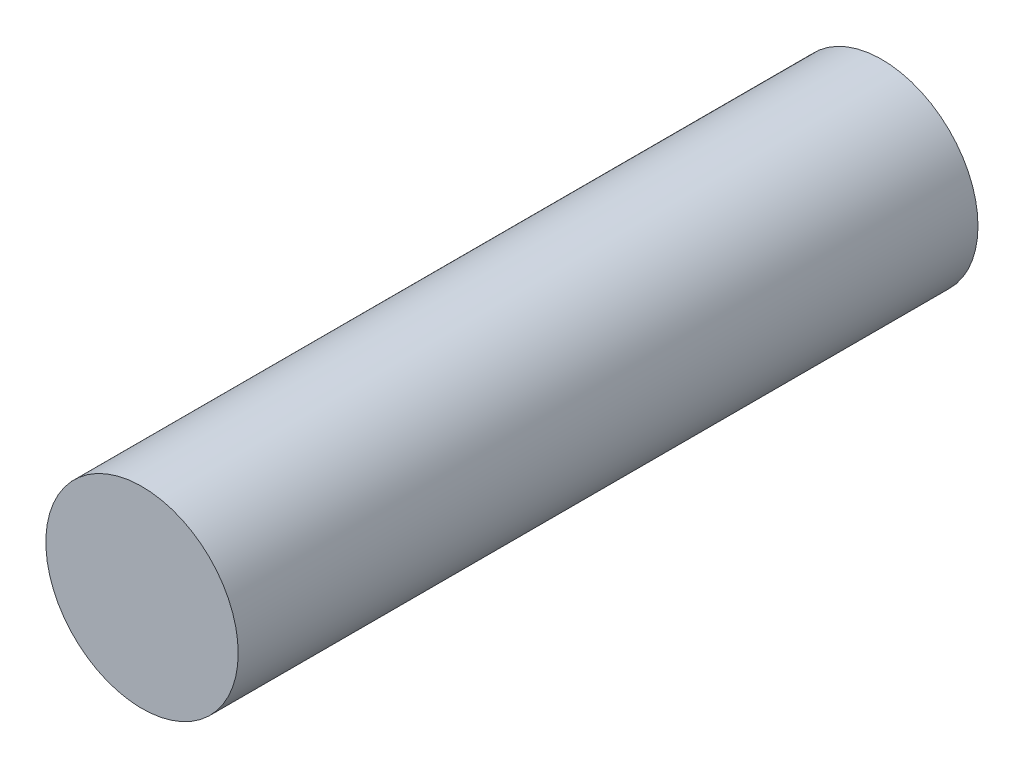
ISO-10303-21;
HEADER;
FILE_DESCRIPTION(('STEP AP214'),'2;1');
FILE_NAME('part.step','',(''),(''),'','','');
FILE_SCHEMA(('AUTOMOTIVE_DESIGN { 1 0 10303 214 1 1 1 1 }'));
ENDSEC;
DATA;
#1=APPLICATION_CONTEXT('core data for automotive mechanical design processes');
#2=APPLICATION_PROTOCOL_DEFINITION('international standard','automotive_design',2000,#1);
#3=PRODUCT_CONTEXT('',#1,'mechanical');
#4=PRODUCT('Part','Part','',(#3));
#5=PRODUCT_RELATED_PRODUCT_CATEGORY('part','',(#4));
#6=PRODUCT_DEFINITION_FORMATION('','',#4);
#7=PRODUCT_DEFINITION_CONTEXT('part definition',#1,'design');
#8=PRODUCT_DEFINITION('design','',#6,#7);
#9=PRODUCT_DEFINITION_SHAPE('','',#8);
#10=(LENGTH_UNIT() NAMED_UNIT(*) SI_UNIT(.MILLI.,.METRE.));
#11=(NAMED_UNIT(*) PLANE_ANGLE_UNIT() SI_UNIT($,.RADIAN.));
#12=(NAMED_UNIT(*) SI_UNIT($,.STERADIAN.) SOLID_ANGLE_UNIT());
#13=UNCERTAINTY_MEASURE_WITH_UNIT(LENGTH_MEASURE(1.E-05),#10,'distance_accuracy_value','');
#14=(GEOMETRIC_REPRESENTATION_CONTEXT(3) GLOBAL_UNCERTAINTY_ASSIGNED_CONTEXT((#13)) GLOBAL_UNIT_ASSIGNED_CONTEXT((#10,
#11,#12)) REPRESENTATION_CONTEXT('',''));
#15=CARTESIAN_POINT('',(0.,0.,0.));
#16=DIRECTION('',(0.,0.,1.));
#17=DIRECTION('',(1.,0.,0.));
#18=AXIS2_PLACEMENT_3D('',#15,#16,#17);
#19=CARTESIAN_POINT('',(0.,0.,5.));
#20=DIRECTION('',(0.,0.,-1.));
#21=DIRECTION('',(-1.,0.,0.));
#22=AXIS2_PLACEMENT_3D('',#19,#20,#21);
#23=CYLINDRICAL_SURFACE('',#22,0.649999999999998);
#24=CARTESIAN_POINT('',(0.,0.,5.));
#25=DIRECTION('',(0.,0.,1.));
#26=DIRECTION('',(1.,0.,0.));
#27=AXIS2_PLACEMENT_3D('',#24,#25,#26);
#28=CIRCLE('',#27,0.649999999999998);
#29=CARTESIAN_POINT('',(0.649999999999998,0.,5.));
#30=VERTEX_POINT('',#29);
#31=EDGE_CURVE('E10',#30,#30,#28,.T.);
#32=ORIENTED_EDGE('',*,*,#31,.F.);
#33=EDGE_LOOP('',(#32));
#34=FACE_BOUND('',#33,.T.);
#35=CARTESIAN_POINT('',(0.,0.,0.));
#36=DIRECTION('',(0.,0.,1.));
#37=DIRECTION('',(1.,0.,0.));
#38=AXIS2_PLACEMENT_3D('',#35,#36,#37);
#39=CIRCLE('',#38,0.649999999999998);
#40=CARTESIAN_POINT('',(0.649999999999998,0.,0.));
#41=VERTEX_POINT('',#40);
#42=EDGE_CURVE('E34',#41,#41,#39,.T.);
#43=ORIENTED_EDGE('',*,*,#42,.T.);
#44=EDGE_LOOP('',(#43));
#45=FACE_BOUND('',#44,.T.);
#46=ADVANCED_FACE('F31',(#34,#45),#23,.T.);
#47=CARTESIAN_POINT('',(0.,0.,5.));
#48=DIRECTION('',(0.,0.,1.));
#49=DIRECTION('',(1.,0.,0.));
#50=AXIS2_PLACEMENT_3D('',#47,#48,#49);
#51=PLANE('',#50);
#52=ORIENTED_EDGE('',*,*,#31,.T.);
#53=EDGE_LOOP('',(#52));
#54=FACE_BOUND('',#53,.T.);
#55=ADVANCED_FACE('F46',(#54),#51,.T.);
#56=CARTESIAN_POINT('',(0.,0.,0.));
#57=DIRECTION('',(0.,0.,1.));
#58=DIRECTION('',(1.,0.,0.));
#59=AXIS2_PLACEMENT_3D('',#56,#57,#58);
#60=PLANE('',#59);
#61=ORIENTED_EDGE('',*,*,#42,.F.);
#62=EDGE_LOOP('',(#61));
#63=FACE_BOUND('',#62,.T.);
#64=ADVANCED_FACE('F44',(#63),#60,.F.);
#65=CLOSED_SHELL('',(#46,#55,#64));
#66=MANIFOLD_SOLID_BREP('B2',#65);
#67=ADVANCED_BREP_SHAPE_REPRESENTATION('',(#18,#66),#14);
#68=SHAPE_DEFINITION_REPRESENTATION(#9,#67);
ENDSEC;
END-ISO-10303-21;
